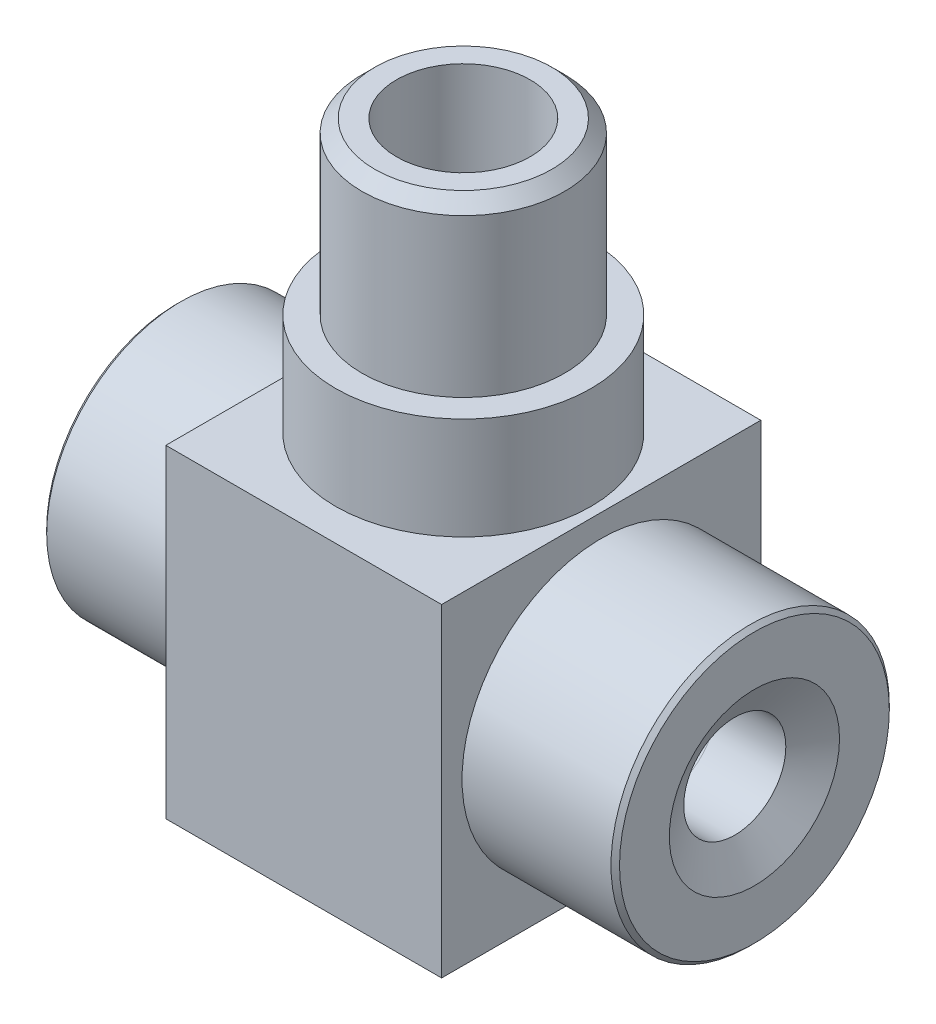
ISO-10303-21;
HEADER;
FILE_DESCRIPTION(('STEP AP214'),'2;1');
FILE_NAME('part.step','',(''),(''),'','','');
FILE_SCHEMA(('AUTOMOTIVE_DESIGN { 1 0 10303 214 1 1 1 1 }'));
ENDSEC;
DATA;
#1=APPLICATION_CONTEXT('core data for automotive mechanical design processes');
#2=APPLICATION_PROTOCOL_DEFINITION('international standard','automotive_design',2000,#1);
#3=PRODUCT_CONTEXT('',#1,'mechanical');
#4=PRODUCT('Part','Part','',(#3));
#5=PRODUCT_RELATED_PRODUCT_CATEGORY('part','',(#4));
#6=PRODUCT_DEFINITION_FORMATION('','',#4);
#7=PRODUCT_DEFINITION_CONTEXT('part definition',#1,'design');
#8=PRODUCT_DEFINITION('design','',#6,#7);
#9=PRODUCT_DEFINITION_SHAPE('','',#8);
#10=(LENGTH_UNIT() NAMED_UNIT(*) SI_UNIT(.MILLI.,.METRE.));
#11=(NAMED_UNIT(*) PLANE_ANGLE_UNIT() SI_UNIT($,.RADIAN.));
#12=(NAMED_UNIT(*) SI_UNIT($,.STERADIAN.) SOLID_ANGLE_UNIT());
#13=UNCERTAINTY_MEASURE_WITH_UNIT(LENGTH_MEASURE(1.E-05),#10,'distance_accuracy_value','');
#14=(GEOMETRIC_REPRESENTATION_CONTEXT(3) GLOBAL_UNCERTAINTY_ASSIGNED_CONTEXT((#13)) GLOBAL_UNIT_ASSIGNED_CONTEXT((#10,
#11,#12)) REPRESENTATION_CONTEXT('',''));
#15=CARTESIAN_POINT('',(0.,0.,0.));
#16=DIRECTION('',(0.,0.,1.));
#17=DIRECTION('',(1.,0.,0.));
#18=AXIS2_PLACEMENT_3D('',#15,#16,#17);
#19=CARTESIAN_POINT('',(0.,0.,37.5));
#20=DIRECTION('',(1.,0.,0.));
#21=DIRECTION('',(0.,0.,-1.));
#22=AXIS2_PLACEMENT_3D('',#19,#20,#21);
#23=PLANE('',#22);
#24=CARTESIAN_POINT('',(0.,19.,18.75));
#25=DIRECTION('',(-1.,0.,0.));
#26=DIRECTION('',(0.,0.,1.));
#27=AXIS2_PLACEMENT_3D('',#24,#25,#26);
#28=CIRCLE('',#27,15.75);
#29=CARTESIAN_POINT('',(0.,19.,34.5));
#30=VERTEX_POINT('',#29);
#31=EDGE_CURVE('E135',#30,#30,#28,.T.);
#32=ORIENTED_EDGE('',*,*,#31,.F.);
#33=EDGE_LOOP('',(#32));
#34=FACE_BOUND('',#33,.T.);
#35=DIRECTION('',(0.,-1.,0.));
#36=VECTOR('',#35,1.);
#37=CARTESIAN_POINT('',(0.,0.,0.));
#38=LINE('',#37,#36);
#39=CARTESIAN_POINT('',(0.,38.,0.));
#40=VERTEX_POINT('',#39);
#41=CARTESIAN_POINT('',(0.,0.,0.));
#42=VERTEX_POINT('',#41);
#43=EDGE_CURVE('E132',#40,#42,#38,.T.);
#44=ORIENTED_EDGE('',*,*,#43,.T.);
#45=DIRECTION('',(0.,0.,-1.));
#46=VECTOR('',#45,1.);
#47=CARTESIAN_POINT('',(0.,0.,37.5));
#48=LINE('',#47,#46);
#49=CARTESIAN_POINT('',(0.,0.,37.5));
#50=VERTEX_POINT('',#49);
#51=EDGE_CURVE('E139',#50,#42,#48,.T.);
#52=ORIENTED_EDGE('',*,*,#51,.F.);
#53=DIRECTION('',(0.,-1.,0.));
#54=VECTOR('',#53,1.);
#55=CARTESIAN_POINT('',(0.,0.,37.5));
#56=LINE('',#55,#54);
#57=CARTESIAN_POINT('',(0.,38.,37.5));
#58=VERTEX_POINT('',#57);
#59=EDGE_CURVE('E140',#58,#50,#56,.T.);
#60=ORIENTED_EDGE('',*,*,#59,.F.);
#61=DIRECTION('',(0.,0.,-1.));
#62=VECTOR('',#61,1.);
#63=CARTESIAN_POINT('',(0.,38.,37.5));
#64=LINE('',#63,#62);
#65=EDGE_CURVE('E146',#58,#40,#64,.T.);
#66=ORIENTED_EDGE('',*,*,#65,.T.);
#67=EDGE_LOOP('',(#44,#52,#60,#66));
#68=FACE_BOUND('',#67,.T.);
#69=ADVANCED_FACE('F45',(#34,#68),#23,.F.);
#70=CARTESIAN_POINT('',(0.,0.,37.5));
#71=DIRECTION('',(0.,1.,0.));
#72=DIRECTION('',(0.,0.,1.));
#73=AXIS2_PLACEMENT_3D('',#70,#71,#72);
#74=PLANE('',#73);
#75=DIRECTION('',(1.,0.,0.));
#76=VECTOR('',#75,1.);
#77=CARTESIAN_POINT('',(0.,0.,0.));
#78=LINE('',#77,#76);
#79=CARTESIAN_POINT('',(32.4,0.,0.));
#80=VERTEX_POINT('',#79);
#81=EDGE_CURVE('E149',#42,#80,#78,.T.);
#82=ORIENTED_EDGE('',*,*,#81,.T.);
#83=DIRECTION('',(0.,0.,-1.));
#84=VECTOR('',#83,1.);
#85=CARTESIAN_POINT('',(32.4,0.,37.5));
#86=LINE('',#85,#84);
#87=CARTESIAN_POINT('',(32.4,0.,37.5));
#88=VERTEX_POINT('',#87);
#89=EDGE_CURVE('E157',#88,#80,#86,.T.);
#90=ORIENTED_EDGE('',*,*,#89,.F.);
#91=DIRECTION('',(1.,0.,0.));
#92=VECTOR('',#91,1.);
#93=CARTESIAN_POINT('',(0.,0.,37.5));
#94=LINE('',#93,#92);
#95=EDGE_CURVE('E99',#50,#88,#94,.T.);
#96=ORIENTED_EDGE('',*,*,#95,.F.);
#97=ORIENTED_EDGE('',*,*,#51,.T.);
#98=EDGE_LOOP('',(#82,#90,#96,#97));
#99=FACE_BOUND('',#98,.T.);
#100=ADVANCED_FACE('F257',(#99),#74,.F.);
#101=CARTESIAN_POINT('',(32.4,0.,37.5));
#102=DIRECTION('',(-1.,0.,0.));
#103=DIRECTION('',(0.,0.,1.));
#104=AXIS2_PLACEMENT_3D('',#101,#102,#103);
#105=PLANE('',#104);
#106=CARTESIAN_POINT('',(32.4,19.,18.75));
#107=DIRECTION('',(1.,0.,0.));
#108=DIRECTION('',(0.,0.,-1.));
#109=AXIS2_PLACEMENT_3D('',#106,#107,#108);
#110=CIRCLE('',#109,16.35);
#111=CARTESIAN_POINT('',(32.4,19.,2.4));
#112=VERTEX_POINT('',#111);
#113=EDGE_CURVE('E162',#112,#112,#110,.T.);
#114=ORIENTED_EDGE('',*,*,#113,.F.);
#115=EDGE_LOOP('',(#114));
#116=FACE_BOUND('',#115,.T.);
#117=DIRECTION('',(0.,1.,0.));
#118=VECTOR('',#117,1.);
#119=CARTESIAN_POINT('',(32.4,0.,0.));
#120=LINE('',#119,#118);
#121=CARTESIAN_POINT('',(32.4,38.,0.));
#122=VERTEX_POINT('',#121);
#123=EDGE_CURVE('E151',#80,#122,#120,.T.);
#124=ORIENTED_EDGE('',*,*,#123,.T.);
#125=DIRECTION('',(0.,0.,-1.));
#126=VECTOR('',#125,1.);
#127=CARTESIAN_POINT('',(32.4,38.,37.5));
#128=LINE('',#127,#126);
#129=CARTESIAN_POINT('',(32.4,38.,37.5));
#130=VERTEX_POINT('',#129);
#131=EDGE_CURVE('E155',#130,#122,#128,.T.);
#132=ORIENTED_EDGE('',*,*,#131,.F.);
#133=DIRECTION('',(0.,1.,0.));
#134=VECTOR('',#133,1.);
#135=CARTESIAN_POINT('',(32.4,0.,37.5));
#136=LINE('',#135,#134);
#137=EDGE_CURVE('E143',#88,#130,#136,.T.);
#138=ORIENTED_EDGE('',*,*,#137,.F.);
#139=ORIENTED_EDGE('',*,*,#89,.T.);
#140=EDGE_LOOP('',(#124,#132,#138,#139));
#141=FACE_BOUND('',#140,.T.);
#142=ADVANCED_FACE('F253',(#116,#141),#105,.F.);
#143=CARTESIAN_POINT('',(0.,38.,37.5));
#144=DIRECTION('',(0.,-1.,0.));
#145=DIRECTION('',(0.,0.,-1.));
#146=AXIS2_PLACEMENT_3D('',#143,#144,#145);
#147=PLANE('',#146);
#148=CARTESIAN_POINT('',(16.2,38.,18.75));
#149=DIRECTION('',(0.,1.,0.));
#150=DIRECTION('',(0.,0.,1.));
#151=AXIS2_PLACEMENT_3D('',#148,#149,#150);
#152=CIRCLE('',#151,15.);
#153=CARTESIAN_POINT('',(16.2,38.,33.75));
#154=VERTEX_POINT('',#153);
#155=EDGE_CURVE('E175',#154,#154,#152,.T.);
#156=ORIENTED_EDGE('',*,*,#155,.F.);
#157=EDGE_LOOP('',(#156));
#158=FACE_BOUND('',#157,.T.);
#159=DIRECTION('',(-1.,0.,0.));
#160=VECTOR('',#159,1.);
#161=CARTESIAN_POINT('',(0.,38.,0.));
#162=LINE('',#161,#160);
#163=EDGE_CURVE('E91',#122,#40,#162,.T.);
#164=ORIENTED_EDGE('',*,*,#163,.T.);
#165=ORIENTED_EDGE('',*,*,#65,.F.);
#166=DIRECTION('',(-1.,0.,0.));
#167=VECTOR('',#166,1.);
#168=CARTESIAN_POINT('',(0.,38.,37.5));
#169=LINE('',#168,#167);
#170=EDGE_CURVE('E70',#130,#58,#169,.T.);
#171=ORIENTED_EDGE('',*,*,#170,.F.);
#172=ORIENTED_EDGE('',*,*,#131,.T.);
#173=EDGE_LOOP('',(#164,#165,#171,#172));
#174=FACE_BOUND('',#173,.T.);
#175=ADVANCED_FACE('F247',(#158,#174),#147,.F.);
#176=CARTESIAN_POINT('',(0.,0.,37.5));
#177=DIRECTION('',(0.,0.,-1.));
#178=DIRECTION('',(-1.,0.,0.));
#179=AXIS2_PLACEMENT_3D('',#176,#177,#178);
#180=PLANE('',#179);
#181=ORIENTED_EDGE('',*,*,#59,.T.);
#182=ORIENTED_EDGE('',*,*,#95,.T.);
#183=ORIENTED_EDGE('',*,*,#137,.T.);
#184=ORIENTED_EDGE('',*,*,#170,.T.);
#185=EDGE_LOOP('',(#181,#182,#183,#184));
#186=FACE_BOUND('',#185,.T.);
#187=ADVANCED_FACE('F244',(#186),#180,.F.);
#188=CARTESIAN_POINT('',(0.,0.,0.));
#189=DIRECTION('',(0.,0.,-1.));
#190=DIRECTION('',(-1.,0.,0.));
#191=AXIS2_PLACEMENT_3D('',#188,#189,#190);
#192=PLANE('',#191);
#193=ORIENTED_EDGE('',*,*,#43,.F.);
#194=ORIENTED_EDGE('',*,*,#163,.F.);
#195=ORIENTED_EDGE('',*,*,#123,.F.);
#196=ORIENTED_EDGE('',*,*,#81,.F.);
#197=EDGE_LOOP('',(#193,#194,#195,#196));
#198=FACE_BOUND('',#197,.T.);
#199=ADVANCED_FACE('F242',(#198),#192,.T.);
#200=CARTESIAN_POINT('',(-17.5,19.,18.75));
#201=DIRECTION('',(1.,0.,0.));
#202=DIRECTION('',(0.,0.,-1.));
#203=AXIS2_PLACEMENT_3D('',#200,#201,#202);
#204=CYLINDRICAL_SURFACE('',#203,15.75);
#205=CARTESIAN_POINT('',(-17.,19.,18.75));
#206=DIRECTION('',(-1.,0.,0.));
#207=DIRECTION('',(0.,0.,1.));
#208=AXIS2_PLACEMENT_3D('',#205,#206,#207);
#209=CIRCLE('',#208,15.75);
#210=CARTESIAN_POINT('',(-17.,19.,34.5));
#211=VERTEX_POINT('',#210);
#212=EDGE_CURVE('E298',#211,#211,#209,.F.);
#213=ORIENTED_EDGE('',*,*,#212,.T.);
#214=EDGE_LOOP('',(#213));
#215=FACE_BOUND('',#214,.T.);
#216=ORIENTED_EDGE('',*,*,#31,.T.);
#217=EDGE_LOOP('',(#216));
#218=FACE_BOUND('',#217,.T.);
#219=ADVANCED_FACE('F238',(#215,#218),#204,.T.);
#220=CARTESIAN_POINT('',(-17.5,19.,18.75));
#221=DIRECTION('',(-1.,0.,0.));
#222=DIRECTION('',(0.,0.,1.));
#223=AXIS2_PLACEMENT_3D('',#220,#221,#222);
#224=PLANE('',#223);
#225=CARTESIAN_POINT('',(-17.5,19.,18.75));
#226=DIRECTION('',(-1.,0.,0.));
#227=DIRECTION('',(0.,0.,1.));
#228=AXIS2_PLACEMENT_3D('',#225,#226,#227);
#229=CIRCLE('',#228,15.25);
#230=CARTESIAN_POINT('',(-17.5,19.,34.));
#231=VERTEX_POINT('',#230);
#232=EDGE_CURVE('E302',#231,#231,#229,.T.);
#233=ORIENTED_EDGE('',*,*,#232,.T.);
#234=EDGE_LOOP('',(#233));
#235=FACE_BOUND('',#234,.T.);
#236=CARTESIAN_POINT('',(-17.5,19.,18.75));
#237=DIRECTION('',(-1.,0.,0.));
#238=DIRECTION('',(0.,0.,1.));
#239=AXIS2_PLACEMENT_3D('',#236,#237,#238);
#240=CIRCLE('',#239,9.3);
#241=CARTESIAN_POINT('',(-17.5,19.,28.05));
#242=VERTEX_POINT('',#241);
#243=EDGE_CURVE('E126',#242,#242,#240,.T.);
#244=ORIENTED_EDGE('',*,*,#243,.F.);
#245=EDGE_LOOP('',(#244));
#246=FACE_BOUND('',#245,.T.);
#247=ADVANCED_FACE('F234',(#235,#246),#224,.T.);
#248=CARTESIAN_POINT('',(0.499999999999997,19.,18.75));
#249=DIRECTION('',(-1.,0.,0.));
#250=DIRECTION('',(0.,0.,1.));
#251=AXIS2_PLACEMENT_3D('',#248,#249,#250);
#252=CYLINDRICAL_SURFACE('',#251,9.3);
#253=CARTESIAN_POINT('',(0.499999999999997,19.,18.75));
#254=DIRECTION('',(-1.,0.,0.));
#255=DIRECTION('',(0.,0.,1.));
#256=AXIS2_PLACEMENT_3D('',#253,#254,#255);
#257=CIRCLE('',#256,9.3);
#258=CARTESIAN_POINT('',(0.499999999999997,19.,28.05));
#259=VERTEX_POINT('',#258);
#260=EDGE_CURVE('E129',#259,#259,#257,.T.);
#261=ORIENTED_EDGE('',*,*,#260,.F.);
#262=EDGE_LOOP('',(#261));
#263=FACE_BOUND('',#262,.T.);
#264=ORIENTED_EDGE('',*,*,#243,.T.);
#265=EDGE_LOOP('',(#264));
#266=FACE_BOUND('',#265,.T.);
#267=ADVANCED_FACE('F231',(#263,#266),#252,.F.);
#268=CARTESIAN_POINT('',(0.499999999999997,19.,18.75));
#269=DIRECTION('',(-1.,0.,0.));
#270=DIRECTION('',(0.,0.,1.));
#271=AXIS2_PLACEMENT_3D('',#268,#269,#270);
#272=PLANE('',#271);
#273=CARTESIAN_POINT('',(0.499999999999997,15.,18.75));
#274=DIRECTION('',(-1.,0.,0.));
#275=DIRECTION('',(0.,0.,1.));
#276=AXIS2_PLACEMENT_3D('',#273,#274,#275);
#277=CIRCLE('',#276,2.);
#278=CARTESIAN_POINT('',(0.499999999999997,15.5,16.8135083268963));
#279=VERTEX_POINT('',#278);
#280=CARTESIAN_POINT('',(0.499999999999997,15.5,20.6864916731037));
#281=VERTEX_POINT('',#280);
#282=EDGE_CURVE('E107',#279,#281,#277,.T.);
#283=ORIENTED_EDGE('',*,*,#282,.F.);
#284=CARTESIAN_POINT('',(0.499999999999997,19.,18.75));
#285=DIRECTION('',(-1.,0.,0.));
#286=DIRECTION('',(0.,0.,1.));
#287=AXIS2_PLACEMENT_3D('',#284,#285,#286);
#288=CIRCLE('',#287,4.);
#289=EDGE_CURVE('E119',#281,#279,#288,.T.);
#290=ORIENTED_EDGE('',*,*,#289,.F.);
#291=EDGE_LOOP('',(#283,#290));
#292=FACE_BOUND('',#291,.T.);
#293=ORIENTED_EDGE('',*,*,#260,.T.);
#294=EDGE_LOOP('',(#293));
#295=FACE_BOUND('',#294,.T.);
#296=ADVANCED_FACE('F123',(#292,#295),#272,.T.);
#297=CARTESIAN_POINT('',(2.9,19.,18.75));
#298=DIRECTION('',(-1.,0.,0.));
#299=DIRECTION('',(0.,0.,1.));
#300=AXIS2_PLACEMENT_3D('',#297,#298,#299);
#301=CYLINDRICAL_SURFACE('',#300,4.);
#302=CARTESIAN_POINT('',(2.9,19.,18.75));
#303=DIRECTION('',(-1.,0.,0.));
#304=DIRECTION('',(0.,0.,1.));
#305=AXIS2_PLACEMENT_3D('',#302,#303,#304);
#306=CIRCLE('',#305,4.);
#307=CARTESIAN_POINT('',(2.9,15.5,20.6864916731037));
#308=VERTEX_POINT('',#307);
#309=CARTESIAN_POINT('',(2.9,15.5,16.8135083268963));
#310=VERTEX_POINT('',#309);
#311=EDGE_CURVE('E121',#308,#310,#306,.T.);
#312=ORIENTED_EDGE('',*,*,#311,.F.);
#313=DIRECTION('',(-1.,0.,0.));
#314=VECTOR('',#313,1.);
#315=CARTESIAN_POINT('',(9.8,15.5,20.6864916731037));
#316=LINE('',#315,#314);
#317=EDGE_CURVE('E61',#308,#281,#316,.T.);
#318=ORIENTED_EDGE('',*,*,#317,.T.);
#319=ORIENTED_EDGE('',*,*,#289,.T.);
#320=DIRECTION('',(-1.,0.,0.));
#321=VECTOR('',#320,1.);
#322=CARTESIAN_POINT('',(9.8,15.5,16.8135083268963));
#323=LINE('',#322,#321);
#324=EDGE_CURVE('E110',#279,#310,#323,.F.);
#325=ORIENTED_EDGE('',*,*,#324,.T.);
#326=EDGE_LOOP('',(#312,#318,#319,#325));
#327=FACE_BOUND('',#326,.T.);
#328=ADVANCED_FACE('F118',(#327),#301,.F.);
#329=CARTESIAN_POINT('',(2.9,19.,18.75));
#330=DIRECTION('',(-1.,0.,0.));
#331=DIRECTION('',(0.,0.,1.));
#332=AXIS2_PLACEMENT_3D('',#329,#330,#331);
#333=PLANE('',#332);
#334=CARTESIAN_POINT('',(2.9,15.,18.75));
#335=DIRECTION('',(-1.,0.,0.));
#336=DIRECTION('',(0.,0.,1.));
#337=AXIS2_PLACEMENT_3D('',#334,#335,#336);
#338=CIRCLE('',#337,2.);
#339=EDGE_CURVE('E138',#308,#310,#338,.T.);
#340=ORIENTED_EDGE('',*,*,#339,.F.);
#341=ORIENTED_EDGE('',*,*,#311,.T.);
#342=EDGE_LOOP('',(#340,#341));
#343=FACE_BOUND('',#342,.T.);
#344=ADVANCED_FACE('F221',(#343),#333,.T.);
#345=CARTESIAN_POINT('',(19.1,15.,18.75));
#346=DIRECTION('',(-1.,0.,0.));
#347=DIRECTION('',(0.,0.,1.));
#348=AXIS2_PLACEMENT_3D('',#345,#346,#347);
#349=CYLINDRICAL_SURFACE('',#348,2.);
#350=CARTESIAN_POINT('',(12.1688711258507,15.,20.75));
#351=CARTESIAN_POINT('',(12.1688654754809,14.8940960075364,20.749994845946));
#352=CARTESIAN_POINT('',(12.1646370580432,14.7880204003675,20.741534564925));
#353=CARTESIAN_POINT('',(12.1482947441444,14.5789927534369,20.708063879802));
#354=CARTESIAN_POINT('',(12.1361608573423,14.4760493265402,20.6830115171003));
#355=CARTESIAN_POINT('',(12.1056734527162,14.276686661753,20.6175585342882));
#356=CARTESIAN_POINT('',(12.0873477072056,14.1802405586167,20.5772263523974));
#357=CARTESIAN_POINT('',(12.046583611169,13.9955085200925,20.4825641714106));
#358=CARTESIAN_POINT('',(12.0241458422428,13.9072214333559,20.4282361514295));
#359=CARTESIAN_POINT('',(11.9759067038502,13.7349947064041,20.3030018797566));
#360=CARTESIAN_POINT('',(11.9499817406305,13.651702379109,20.2312525897757));
#361=CARTESIAN_POINT('',(11.8986983452791,13.4978463794969,20.0749775726925));
#362=CARTESIAN_POINT('',(11.8733401536952,13.4272880250785,19.9904465346985));
#363=CARTESIAN_POINT('',(11.8245094868555,13.2974363788131,19.8057677022595));
#364=CARTESIAN_POINT('',(11.8011971519924,13.2388929147893,19.7050464520331));
#365=CARTESIAN_POINT('',(11.7606253808719,13.1398668377348,19.4939588712212));
#366=CARTESIAN_POINT('',(11.7433629064172,13.0993751564379,19.3835974167661));
#367=CARTESIAN_POINT('',(11.7177163998329,13.0400153309625,19.1631791162345));
#368=CARTESIAN_POINT('',(11.7088737925011,13.0200250592559,19.0534789509025));
#369=CARTESIAN_POINT('',(11.699383064831,12.9985876527568,18.8319497402519));
#370=CARTESIAN_POINT('',(11.6987311292096,12.9971318844338,18.7201217104243));
#371=CARTESIAN_POINT('',(11.7054413723545,13.0122649050051,18.5057554421316));
#372=CARTESIAN_POINT('',(11.7122531245509,13.0276142971369,18.4031090532758));
#373=CARTESIAN_POINT('',(11.7323452522346,13.0737682258513,18.2020268405944));
#374=CARTESIAN_POINT('',(11.7456261068095,13.104573907098,18.1035913292047));
#375=CARTESIAN_POINT('',(11.7776494333513,13.1810974465275,17.9119002288363));
#376=CARTESIAN_POINT('',(11.7964720748493,13.2270354641046,17.8187464751077));
#377=CARTESIAN_POINT('',(11.8377829933051,13.3322837591184,17.6412251429009));
#378=CARTESIAN_POINT('',(11.8602726056118,13.391598910943,17.5568607835437));
#379=CARTESIAN_POINT('',(11.9087920018052,13.5273187397619,17.3922577062266));
#380=CARTESIAN_POINT('',(11.9349611032174,13.6047001513247,17.3128643391118));
#381=CARTESIAN_POINT('',(11.9866238829718,13.7716533150306,17.1677849237987));
#382=CARTESIAN_POINT('',(12.012117219626,13.8612310986921,17.1021056986818));
#383=CARTESIAN_POINT('',(12.0606173706771,14.0546954041424,16.9837094216367));
#384=CARTESIAN_POINT('',(12.0834763417536,14.1590225751376,16.9316464025729));
#385=CARTESIAN_POINT('',(12.1222911806577,14.3762433356194,16.8461829820641));
#386=CARTESIAN_POINT('',(12.1382527622511,14.4891297431869,16.8127671266812));
#387=CARTESIAN_POINT('',(12.1599886011254,14.7117707571912,16.7678567301618));
#388=CARTESIAN_POINT('',(12.1664034320343,14.821182336561,16.7549791345838));
#389=CARTESIAN_POINT('',(12.1701569966405,15.0407678949219,16.7474037911655));
#390=CARTESIAN_POINT('',(12.1674996685784,15.1509415223833,16.7526981548503));
#391=CARTESIAN_POINT('',(12.1540771096382,15.3599260820209,16.7800505019307));
#392=CARTESIAN_POINT('',(12.1439538175059,15.4589574833891,16.8007824265676));
#393=CARTESIAN_POINT('',(12.1176015988103,15.6520241716129,16.8565987053885));
#394=CARTESIAN_POINT('',(12.1013711069214,15.7460581705352,16.8916867393634));
#395=CARTESIAN_POINT('',(12.063756456985,15.931183934964,16.9769389749489));
#396=CARTESIAN_POINT('',(12.0421741858521,16.0219557600174,17.0277075339259));
#397=CARTESIAN_POINT('',(11.996534938976,16.1941636211632,17.1423052442638));
#398=CARTESIAN_POINT('',(11.972476801683,16.2755952370762,17.2061405398872));
#399=CARTESIAN_POINT('',(11.9218417011731,16.4348780958649,17.3521882649405));
#400=CARTESIAN_POINT('',(11.8952425717971,16.5116543051134,17.4355704012763));
#401=CARTESIAN_POINT('',(11.8445981119452,16.6503639401814,17.6146049894662));
#402=CARTESIAN_POINT('',(11.820553142668,16.7122952682512,17.7102591725707));
#403=CARTESIAN_POINT('',(11.7774014521205,16.8198434012168,17.9125095664967));
#404=CARTESIAN_POINT('',(11.7583386916143,16.8653162513235,18.0191923060331));
#405=CARTESIAN_POINT('',(11.7276371057669,16.937291730698,18.2397708027772));
#406=CARTESIAN_POINT('',(11.715993186549,16.963807377768,18.3536615516741));
#407=CARTESIAN_POINT('',(11.70209931183,16.9953168417001,18.5758857424596));
#408=CARTESIAN_POINT('',(11.6991907946577,17.001820409428,18.6839650764729));
#409=CARTESIAN_POINT('',(11.7011978159582,16.9973051398305,18.899670109771));
#410=CARTESIAN_POINT('',(11.7061116226679,16.9862901808846,19.0072959041751));
#411=CARTESIAN_POINT('',(11.7228437385024,16.9481275977651,19.2140767593867));
#412=CARTESIAN_POINT('',(11.7343460092302,16.9217174926349,19.3133957823355));
#413=CARTESIAN_POINT('',(11.7629081500118,16.8543761904889,19.5061179532406));
#414=CARTESIAN_POINT('',(11.7799689949602,16.8134424461219,19.5995200600194));
#415=CARTESIAN_POINT('',(11.8190066676703,16.7161514669342,19.7824971132625));
#416=CARTESIAN_POINT('',(11.8411729710905,16.6591733135064,19.871700441136));
#417=CARTESIAN_POINT('',(11.8878821604987,16.5322660024435,20.0396715958599));
#418=CARTESIAN_POINT('',(11.9124260499165,16.4623313652272,20.1184349831628));
#419=CARTESIAN_POINT('',(11.9635909201895,16.3050352560919,20.2697738304058));
#420=CARTESIAN_POINT('',(11.9902232130091,16.2167349511258,20.341373030715));
#421=CARTESIAN_POINT('',(12.0406812908481,16.028651296375,20.468950306289));
#422=CARTESIAN_POINT('',(12.0645053176205,15.9288608291047,20.5249186248139));
#423=CARTESIAN_POINT('',(12.1064060485751,15.7197445810451,20.6195429827875));
#424=CARTESIAN_POINT('',(12.1244603432878,15.6103836731994,20.6581317523494));
#425=CARTESIAN_POINT('',(12.1519690321072,15.3858092794601,20.7158326362609));
#426=CARTESIAN_POINT('',(12.1614522728447,15.2706168131761,20.7350101073653));
#427=CARTESIAN_POINT('',(12.1668929271312,15.128943512372,20.7460073135799));
#428=CARTESIAN_POINT('',(12.1676331480938,15.1031862568132,20.7475030821723));
#429=CARTESIAN_POINT('',(12.168622942877,15.0516227344512,20.7495000672147));
#430=CARTESIAN_POINT('',(12.1688725032547,15.0258164663244,20.7500012564159));
#431=CARTESIAN_POINT('',(12.1688711258507,15.,20.75));
#432=B_SPLINE_CURVE_WITH_KNOTS('',3,(#350,#351,#352,#353,#354,#355,#356,#357,#358,#359,#360,
#361,#362,#363,#364,#365,#366,#367,#368,#369,#370,#371,#372,#373,#374,#375,#376,#377,#378,#379,
#380,#381,#382,#383,#384,#385,#386,#387,#388,#389,#390,#391,#392,#393,#394,#395,#396,#397,#398,
#399,#400,#401,#402,#403,#404,#405,#406,#407,#408,#409,#410,#411,#412,#413,#414,#415,#416,#417,
#418,#419,#420,#421,#422,#423,#424,#425,#426,#427,#428,#429,#430,#431),.UNSPECIFIED.,.T.,.F.,(4,
2,2,2,2,2,2,2,2,2,2,2,2,2,2,2,2,2,2,2,2,2,2,2,2,2,2,2,2,2,2,2,2,2,2,2,2,2,2,2,4),(0.,
0.31760334437537,0.636012936965872,0.953012920070959,1.26996810161855,1.6073589609112,
1.94489039529369,2.29948552911719,2.65390233172428,2.98767546043325,3.3212931090692,
3.63186770859037,3.94246531208843,4.2577975938606,4.57324496324738,4.91348424244389,
5.25389239679148,5.60848267098925,5.96277863847742,6.29202080550634,6.62112006609385,
6.92480624185222,7.22857030796274,7.54592692136879,7.86343310695169,8.21110201111792,
8.55882001591001,8.90950977437052,9.25995848428581,9.58322590889841,9.9064217761665,
10.2152769219976,10.5241862657993,10.8472538994055,11.1704584786024,11.5191241833328,
11.8680070399787,12.2182289273672,12.5672676750844,12.6446884712522,12.7221113884988),.UNSPECIFIED.);
#433=CARTESIAN_POINT('',(12.1688711258507,15.,20.75));
#434=VERTEX_POINT('',#433);
#435=EDGE_CURVE('E184',#434,#434,#432,.T.);
#436=ORIENTED_EDGE('',*,*,#435,.T.);
#437=EDGE_LOOP('',(#436));
#438=FACE_BOUND('',#437,.T.);
#439=ORIENTED_EDGE('',*,*,#339,.T.);
#440=ORIENTED_EDGE('',*,*,#324,.F.);
#441=ORIENTED_EDGE('',*,*,#282,.T.);
#442=ORIENTED_EDGE('',*,*,#317,.F.);
#443=EDGE_LOOP('',(#439,#440,#441,#442));
#444=FACE_BOUND('',#443,.T.);
#445=ADVANCED_FACE('F108',(#438,#444),#349,.F.);
#446=CARTESIAN_POINT('',(50.4,19.,18.75));
#447=DIRECTION('',(-1.,0.,0.));
#448=DIRECTION('',(0.,0.,1.));
#449=AXIS2_PLACEMENT_3D('',#446,#447,#448);
#450=CYLINDRICAL_SURFACE('',#449,16.35);
#451=CARTESIAN_POINT('',(49.9,19.,18.75));
#452=DIRECTION('',(1.,0.,0.));
#453=DIRECTION('',(0.,0.,-1.));
#454=AXIS2_PLACEMENT_3D('',#451,#452,#453);
#455=CIRCLE('',#454,16.35);
#456=CARTESIAN_POINT('',(49.9,19.,2.4));
#457=VERTEX_POINT('',#456);
#458=EDGE_CURVE('E293',#457,#457,#455,.F.);
#459=ORIENTED_EDGE('',*,*,#458,.T.);
#460=EDGE_LOOP('',(#459));
#461=FACE_BOUND('',#460,.T.);
#462=ORIENTED_EDGE('',*,*,#113,.T.);
#463=EDGE_LOOP('',(#462));
#464=FACE_BOUND('',#463,.T.);
#465=ADVANCED_FACE('F220',(#461,#464),#450,.T.);
#466=CARTESIAN_POINT('',(50.4,19.,18.75));
#467=DIRECTION('',(1.,0.,0.));
#468=DIRECTION('',(0.,0.,-1.));
#469=AXIS2_PLACEMENT_3D('',#466,#467,#468);
#470=PLANE('',#469);
#471=CARTESIAN_POINT('',(50.4,19.,18.75));
#472=DIRECTION('',(1.,0.,0.));
#473=DIRECTION('',(0.,0.,-1.));
#474=AXIS2_PLACEMENT_3D('',#471,#472,#473);
#475=CIRCLE('',#474,15.85);
#476=CARTESIAN_POINT('',(50.4,19.,2.9));
#477=VERTEX_POINT('',#476);
#478=EDGE_CURVE('E296',#477,#477,#475,.T.);
#479=ORIENTED_EDGE('',*,*,#478,.T.);
#480=EDGE_LOOP('',(#479));
#481=FACE_BOUND('',#480,.T.);
#482=CARTESIAN_POINT('',(50.4,19.,18.75));
#483=DIRECTION('',(1.,0.,0.));
#484=DIRECTION('',(0.,0.,-1.));
#485=AXIS2_PLACEMENT_3D('',#482,#483,#484);
#486=CIRCLE('',#485,10.);
#487=CARTESIAN_POINT('',(50.4,19.,8.74999999999999));
#488=VERTEX_POINT('',#487);
#489=EDGE_CURVE('E166',#488,#488,#486,.F.);
#490=ORIENTED_EDGE('',*,*,#489,.T.);
#491=EDGE_LOOP('',(#490));
#492=FACE_BOUND('',#491,.T.);
#493=ADVANCED_FACE('F365',(#481,#492),#470,.T.);
#494=CARTESIAN_POINT('',(37.9,19.,18.75));
#495=DIRECTION('',(1.,0.,0.));
#496=DIRECTION('',(0.,0.,-1.));
#497=AXIS2_PLACEMENT_3D('',#494,#495,#496);
#498=CYLINDRICAL_SURFACE('',#497,6.);
#499=CARTESIAN_POINT('',(39.9,19.,18.75));
#500=DIRECTION('',(1.,0.,0.));
#501=DIRECTION('',(0.,0.,-1.));
#502=AXIS2_PLACEMENT_3D('',#499,#500,#501);
#503=CIRCLE('',#502,6.);
#504=CARTESIAN_POINT('',(39.9,19.,12.75));
#505=VERTEX_POINT('',#504);
#506=EDGE_CURVE('E172',#505,#505,#503,.F.);
#507=ORIENTED_EDGE('',*,*,#506,.T.);
#508=EDGE_LOOP('',(#507));
#509=FACE_BOUND('',#508,.T.);
#510=CARTESIAN_POINT('',(48.0905989232415,19.,18.75));
#511=DIRECTION('',(1.,0.,0.));
#512=DIRECTION('',(0.,0.,-1.));
#513=AXIS2_PLACEMENT_3D('',#510,#511,#512);
#514=CIRCLE('',#513,6.);
#515=CARTESIAN_POINT('',(48.0905989232415,19.,12.75));
#516=VERTEX_POINT('',#515);
#517=EDGE_CURVE('E163',#516,#516,#514,.T.);
#518=ORIENTED_EDGE('',*,*,#517,.T.);
#519=EDGE_LOOP('',(#518));
#520=FACE_BOUND('',#519,.T.);
#521=ADVANCED_FACE('F370',(#509,#520),#498,.F.);
#522=CARTESIAN_POINT('',(37.9,19.,18.75));
#523=DIRECTION('',(1.,0.,0.));
#524=DIRECTION('',(0.,0.,-1.));
#525=AXIS2_PLACEMENT_3D('',#522,#523,#524);
#526=PLANE('',#525);
#527=CARTESIAN_POINT('',(37.9,19.,18.75));
#528=DIRECTION('',(1.,0.,0.));
#529=DIRECTION('',(0.,0.,-1.));
#530=AXIS2_PLACEMENT_3D('',#527,#528,#529);
#531=CIRCLE('',#530,4.);
#532=CARTESIAN_POINT('',(37.9,19.,14.75));
#533=VERTEX_POINT('',#532);
#534=EDGE_CURVE('E169',#533,#533,#531,.T.);
#535=ORIENTED_EDGE('',*,*,#534,.T.);
#536=EDGE_LOOP('',(#535));
#537=FACE_BOUND('',#536,.T.);
#538=CARTESIAN_POINT('',(37.9,19.,18.75));
#539=DIRECTION('',(1.,0.,0.));
#540=DIRECTION('',(0.,0.,-1.));
#541=AXIS2_PLACEMENT_3D('',#538,#539,#540);
#542=CIRCLE('',#541,2.5);
#543=CARTESIAN_POINT('',(37.9,19.,16.25));
#544=VERTEX_POINT('',#543);
#545=EDGE_CURVE('E114',#544,#544,#542,.T.);
#546=ORIENTED_EDGE('',*,*,#545,.F.);
#547=EDGE_LOOP('',(#546));
#548=FACE_BOUND('',#547,.T.);
#549=ADVANCED_FACE('F267',(#537,#548),#526,.T.);
#550=CARTESIAN_POINT('',(48.0905989232415,19.,18.75));
#551=DIRECTION('',(1.,0.,0.));
#552=DIRECTION('',(0.,0.,-1.));
#553=AXIS2_PLACEMENT_3D('',#550,#551,#552);
#554=CONICAL_SURFACE('',#553,6.,1.0471975511966);
#555=ORIENTED_EDGE('',*,*,#489,.F.);
#556=EDGE_LOOP('',(#555));
#557=FACE_BOUND('',#556,.T.);
#558=ORIENTED_EDGE('',*,*,#517,.F.);
#559=EDGE_LOOP('',(#558));
#560=FACE_BOUND('',#559,.T.);
#561=ADVANCED_FACE('F264',(#557,#560),#554,.F.);
#562=CARTESIAN_POINT('',(16.2,19.,18.75));
#563=DIRECTION('',(1.,0.,0.));
#564=DIRECTION('',(0.,0.,-1.));
#565=AXIS2_PLACEMENT_3D('',#562,#563,#564);
#566=CYLINDRICAL_SURFACE('',#565,2.5);
#567=CARTESIAN_POINT('',(19.9416573867739,19.,16.25));
#568=CARTESIAN_POINT('',(19.9416726873018,18.8721323396009,16.2500113220494));
#569=CARTESIAN_POINT('',(19.9483170497897,18.7441529674524,16.2598795376881));
#570=CARTESIAN_POINT('',(19.97384839882,18.4923201029541,16.2987616581353));
#571=CARTESIAN_POINT('',(19.9927555117257,18.3684737459366,16.3278070390731));
#572=CARTESIAN_POINT('',(20.0398993382271,18.1290548830458,16.4032748146643));
#573=CARTESIAN_POINT('',(20.0680766759946,18.013435273413,16.4495868614897));
#574=CARTESIAN_POINT('',(20.1304894158798,17.7916539989819,16.5579342118591));
#575=CARTESIAN_POINT('',(20.1647261630753,17.6854944420248,16.6199730077777));
#576=CARTESIAN_POINT('',(20.2396940348001,17.4735832846136,16.7655015383178));
#577=CARTESIAN_POINT('',(20.2807306976683,17.3690064220367,16.8505450603285));
#578=CARTESIAN_POINT('',(20.3622229945264,17.1746536694825,17.0364624889203));
#579=CARTESIAN_POINT('',(20.4026782589736,17.0848868433534,17.1373460165376));
#580=CARTESIAN_POINT('',(20.482696406447,16.9149101674806,17.3629014771508));
#581=CARTESIAN_POINT('',(20.5218664679031,16.8362396702721,17.4888863034949));
#582=CARTESIAN_POINT('',(20.5907371497202,16.7017583366495,17.7548915688457));
#583=CARTESIAN_POINT('',(20.6204451281028,16.6459297279822,17.894900989947));
#584=CARTESIAN_POINT('',(20.6648062287859,16.5636943117973,18.1724575455885));
#585=CARTESIAN_POINT('',(20.6805196628677,16.5351993970642,18.3092124095443));
#586=CARTESIAN_POINT('',(20.6991626948253,16.5014655122546,18.5863830589989));
#587=CARTESIAN_POINT('',(20.7021022263727,16.4962084711067,18.7267959143272));
#588=CARTESIAN_POINT('',(20.6952695276662,16.5085234963156,18.9911789107194));
#589=CARTESIAN_POINT('',(20.6868211214875,16.5237178496382,19.1153038458625));
#590=CARTESIAN_POINT('',(20.6602965292815,16.5721090033326,19.3589064725007));
#591=CARTESIAN_POINT('',(20.6422196011106,16.6053071914009,19.4783838050078));
#592=CARTESIAN_POINT('',(20.5978060171242,16.6887335049168,19.7109796531948));
#593=CARTESIAN_POINT('',(20.5713861183467,16.7391336940186,19.8240199020297));
#594=CARTESIAN_POINT('',(20.5125199735291,16.8551626151488,20.0402505984926));
#595=CARTESIAN_POINT('',(20.4800718351567,16.9207961307072,20.1434379377399));
#596=CARTESIAN_POINT('',(20.4078528663051,17.0735934614955,20.3490962096578));
#597=CARTESIAN_POINT('',(20.3676693204804,17.1623260278371,20.4502574739773));
#598=CARTESIAN_POINT('',(20.2865010622015,17.3546682688736,20.6370355662016));
#599=CARTESIAN_POINT('',(20.2455155428489,17.4582936713044,20.7226357414321));
#600=CARTESIAN_POINT('',(20.163123978611,17.6889207082924,20.8836709009596));
#601=CARTESIAN_POINT('',(20.1220171494115,17.8171902179464,20.9574790161184));
#602=CARTESIAN_POINT('',(20.0674917760897,18.0193309921106,21.0508285502792));
#603=CARTESIAN_POINT('',(20.0505034104038,18.0883471419892,21.0790547633323));
#604=CARTESIAN_POINT('',(20.0196052952535,18.2292237904501,21.1293879141019));
#605=CARTESIAN_POINT('',(20.0056934430533,18.301082306485,21.1514990339696));
#606=CARTESIAN_POINT('',(19.9825660454845,18.4412551771517,21.1877489372537));
#607=CARTESIAN_POINT('',(19.97306418692,18.5093943122614,21.2023833583374));
#608=CARTESIAN_POINT('',(19.9576487087459,18.6470200576638,21.2259392049674));
#609=CARTESIAN_POINT('',(19.9517329765312,18.7165058496854,21.2348639942583));
#610=CARTESIAN_POINT('',(19.9437735839187,18.8561551646247,21.2468406736909));
#611=CARTESIAN_POINT('',(19.9417269363782,18.9263181226313,21.2498970945591));
#612=CARTESIAN_POINT('',(19.941591158466,19.0666321128593,21.2500979353415));
#613=CARTESIAN_POINT('',(19.9435015737046,19.1367831455251,21.247243034053));
#614=CARTESIAN_POINT('',(19.9539066922312,19.325212663635,21.23160454094));
#615=CARTESIAN_POINT('',(19.9660681233637,19.4428851675594,21.2132791289111));
#616=CARTESIAN_POINT('',(19.9999967187886,19.6730616317667,21.1605964113588));
#617=CARTESIAN_POINT('',(20.0217682717268,19.7855632046983,21.1262317808079));
#618=CARTESIAN_POINT('',(20.0734200279313,20.0077418055562,21.0411100941392));
#619=CARTESIAN_POINT('',(20.103597650075,20.1171109257016,20.9897353611686));
#620=CARTESIAN_POINT('',(20.1685293089739,20.3263257689031,20.8725595783816));
#621=CARTESIAN_POINT('',(20.2032855762368,20.4261668091685,20.8067514868336));
#622=CARTESIAN_POINT('',(20.2802130806217,20.6304906252537,20.6501686403728));
#623=CARTESIAN_POINT('',(20.3226722442094,20.7330968256877,20.5570752676726));
#624=CARTESIAN_POINT('',(20.4055765594881,20.921999358086,20.3547090011428));
#625=CARTESIAN_POINT('',(20.446020455342,21.0082856114409,20.2454261830944));
#626=CARTESIAN_POINT('',(20.523008754933,21.1664329420355,20.0062604275829));
#627=CARTESIAN_POINT('',(20.5592262624207,21.237268076194,19.8755854721733));
#628=CARTESIAN_POINT('',(20.6209063789503,21.3551963131882,19.6016021654531));
#629=CARTESIAN_POINT('',(20.6463803344281,21.4023144741272,19.4583073365757));
#630=CARTESIAN_POINT('',(20.681485199124,21.4666477791198,19.178990109063));
#631=CARTESIAN_POINT('',(20.6924747326529,21.486437422315,19.0437326732373));
#632=CARTESIAN_POINT('',(20.7020067452551,21.5036224015053,18.7713910904093));
#633=CARTESIAN_POINT('',(20.7005560835842,21.5010300784294,18.6343079916669));
#634=CARTESIAN_POINT('',(20.6861017529253,21.4749143746661,18.3756625393492));
#635=CARTESIAN_POINT('',(20.6741753180592,21.4533423582357,18.2538342593847));
#636=CARTESIAN_POINT('',(20.6413325736809,21.3929222824186,18.0158328449745));
#637=CARTESIAN_POINT('',(20.620415212062,21.3540722011564,17.8996603741361));
#638=CARTESIAN_POINT('',(20.5705432910913,21.2590561244478,17.6718522438569));
#639=CARTESIAN_POINT('',(20.541347259891,21.202363175809,17.560491023726));
#640=CARTESIAN_POINT('',(20.477627720165,21.0739354226256,17.3485110387714));
#641=CARTESIAN_POINT('',(20.4431021134758,21.0021946900155,17.2478965312547));
#642=CARTESIAN_POINT('',(20.367171955601,20.8361351797567,17.0478208392219));
#643=CARTESIAN_POINT('',(20.3254345017689,20.7401602264378,16.9498575565794));
#644=CARTESIAN_POINT('',(20.2425254134758,20.533304183114,16.7706674976889));
#645=CARTESIAN_POINT('',(20.2013545489803,20.4224046656363,16.6894617311876));
#646=CARTESIAN_POINT('',(20.1212240848222,20.1789993623462,16.5405519776071));
#647=CARTESIAN_POINT('',(20.0826265303192,20.045520405037,16.4742082130855));
#648=CARTESIAN_POINT('',(20.0334300904575,19.8365266679135,16.3929224772675));
#649=CARTESIAN_POINT('',(20.018489769267,19.7654600807093,16.3688775554243));
#650=CARTESIAN_POINT('',(19.9921532547715,19.6208613995251,16.3271540053638));
#651=CARTESIAN_POINT('',(19.9807548341382,19.5473308873525,16.3094713751026));
#652=CARTESIAN_POINT('',(19.9617084132447,19.3954098742597,16.2802079522334));
#653=CARTESIAN_POINT('',(19.9542323664776,19.3169434783972,16.2689054886822));
#654=CARTESIAN_POINT('',(19.9442022253849,19.15899908791,16.2537981897745));
#655=CARTESIAN_POINT('',(19.9416478713459,19.0795211468866,16.2499929587954));
#656=CARTESIAN_POINT('',(19.9416573867739,19.,16.25));
#657=B_SPLINE_CURVE_WITH_KNOTS('',3,(#567,#568,#569,#570,#571,#572,#573,#574,#575,#576,#577,
#578,#579,#580,#581,#582,#583,#584,#585,#586,#587,#588,#589,#590,#591,#592,#593,#594,#595,#596,
#597,#598,#599,#600,#601,#602,#603,#604,#605,#606,#607,#608,#609,#610,#611,#612,#613,#614,#615,
#616,#617,#618,#619,#620,#621,#622,#623,#624,#625,#626,#627,#628,#629,#630,#631,#632,#633,#634,
#635,#636,#637,#638,#639,#640,#641,#642,#643,#644,#645,#646,#647,#648,#649,#650,#651,#652,#653,
#654,#655,#656),.UNSPECIFIED.,.T.,.F.,(4,2,2,2,2,2,2,2,2,2,2,2,2,2,2,2,2,2,2,2,2,2,2,2,2,2,2,2,
2,2,2,2,2,2,2,2,2,2,2,2,2,2,2,2,4),(0.,0.383275383121335,0.767181418165754,1.14867490739205,
1.5302531876378,1.95124472962169,2.37249297328885,2.8308639411325,3.28887758966411,
3.70817544329898,4.12714717001845,4.50138183787381,4.87564535502261,5.25376784587463,
5.63200923481063,6.05157027592399,6.47157769989119,6.92969119559362,7.15882945779302,
7.38781062115844,7.59850621559528,7.80907756727165,8.01948627997721,8.22987083278616,
8.5871927980406,8.94467811029151,9.31690871248924,9.68932132373674,10.122176331063,
10.5552977873492,11.0117233376161,11.4676656351332,11.8767730047249,12.2856548158304,
12.6568475822263,13.0280837969544,13.4115163637487,13.7951002682315,14.2233400990621,
14.6521136168463,15.1111969694139,15.3403711075502,15.5694008362358,15.80777312205,
16.0461328288286),.UNSPECIFIED.);
#658=CARTESIAN_POINT('',(19.9416573867739,19.,16.25));
#659=VERTEX_POINT('',#658);
#660=EDGE_CURVE('E176',#659,#659,#657,.T.);
#661=ORIENTED_EDGE('',*,*,#660,.T.);
#662=EDGE_LOOP('',(#661));
#663=FACE_BOUND('',#662,.T.);
#664=ORIENTED_EDGE('',*,*,#545,.T.);
#665=EDGE_LOOP('',(#664));
#666=FACE_BOUND('',#665,.T.);
#667=ADVANCED_FACE('F188',(#663,#666),#566,.F.);
#668=CARTESIAN_POINT('',(39.9,19.,18.75));
#669=DIRECTION('',(1.,0.,0.));
#670=DIRECTION('',(0.,0.,-1.));
#671=AXIS2_PLACEMENT_3D('',#668,#669,#670);
#672=TOROIDAL_SURFACE('',#671,4.,2.);
#673=ORIENTED_EDGE('',*,*,#506,.F.);
#674=EDGE_LOOP('',(#673));
#675=FACE_BOUND('',#674,.T.);
#676=ORIENTED_EDGE('',*,*,#534,.F.);
#677=EDGE_LOOP('',(#676));
#678=FACE_BOUND('',#677,.T.);
#679=ADVANCED_FACE('F269',(#675,#678),#672,.F.);
#680=CARTESIAN_POINT('',(16.2,50.,18.75));
#681=DIRECTION('',(0.,-1.,0.));
#682=DIRECTION('',(0.,0.,-1.));
#683=AXIS2_PLACEMENT_3D('',#680,#681,#682);
#684=CYLINDRICAL_SURFACE('',#683,15.);
#685=CARTESIAN_POINT('',(16.2,50.,18.75));
#686=DIRECTION('',(0.,1.,0.));
#687=DIRECTION('',(0.,0.,1.));
#688=AXIS2_PLACEMENT_3D('',#685,#686,#687);
#689=CIRCLE('',#688,15.);
#690=CARTESIAN_POINT('',(16.2,50.,33.75));
#691=VERTEX_POINT('',#690);
#692=EDGE_CURVE('E338',#691,#691,#689,.T.);
#693=ORIENTED_EDGE('',*,*,#692,.F.);
#694=EDGE_LOOP('',(#693));
#695=FACE_BOUND('',#694,.T.);
#696=ORIENTED_EDGE('',*,*,#155,.T.);
#697=EDGE_LOOP('',(#696));
#698=FACE_BOUND('',#697,.T.);
#699=ADVANCED_FACE('F272',(#695,#698),#684,.T.);
#700=CARTESIAN_POINT('',(16.2,50.,18.75));
#701=DIRECTION('',(0.,1.,0.));
#702=DIRECTION('',(0.,0.,1.));
#703=AXIS2_PLACEMENT_3D('',#700,#701,#702);
#704=PLANE('',#703);
#705=CARTESIAN_POINT('',(16.2,50.,18.75));
#706=DIRECTION('',(0.,1.,0.));
#707=DIRECTION('',(0.,0.,1.));
#708=AXIS2_PLACEMENT_3D('',#705,#706,#707);
#709=CIRCLE('',#708,11.9);
#710=CARTESIAN_POINT('',(16.2,50.,30.65));
#711=VERTEX_POINT('',#710);
#712=EDGE_CURVE('E345',#711,#711,#709,.T.);
#713=ORIENTED_EDGE('',*,*,#712,.F.);
#714=EDGE_LOOP('',(#713));
#715=FACE_BOUND('',#714,.T.);
#716=ORIENTED_EDGE('',*,*,#692,.T.);
#717=EDGE_LOOP('',(#716));
#718=FACE_BOUND('',#717,.T.);
#719=ADVANCED_FACE('F405',(#715,#718),#704,.T.);
#720=CARTESIAN_POINT('',(16.2,70.,18.75));
#721=DIRECTION('',(0.,-1.,0.));
#722=DIRECTION('',(0.,0.,-1.));
#723=AXIS2_PLACEMENT_3D('',#720,#721,#722);
#724=CYLINDRICAL_SURFACE('',#723,11.9);
#725=CARTESIAN_POINT('',(16.2,68.5,18.75));
#726=DIRECTION('',(0.,1.,0.));
#727=DIRECTION('',(0.,0.,1.));
#728=AXIS2_PLACEMENT_3D('',#725,#726,#727);
#729=CIRCLE('',#728,11.9);
#730=CARTESIAN_POINT('',(16.2,68.5,30.65));
#731=VERTEX_POINT('',#730);
#732=EDGE_CURVE('E618',#731,#731,#729,.F.);
#733=ORIENTED_EDGE('',*,*,#732,.T.);
#734=EDGE_LOOP('',(#733));
#735=FACE_BOUND('',#734,.T.);
#736=ORIENTED_EDGE('',*,*,#712,.T.);
#737=EDGE_LOOP('',(#736));
#738=FACE_BOUND('',#737,.T.);
#739=ADVANCED_FACE('F412',(#735,#738),#724,.T.);
#740=CARTESIAN_POINT('',(16.2,70.,18.75));
#741=DIRECTION('',(0.,1.,0.));
#742=DIRECTION('',(0.,0.,1.));
#743=AXIS2_PLACEMENT_3D('',#740,#741,#742);
#744=PLANE('',#743);
#745=CARTESIAN_POINT('',(16.2,70.,18.75));
#746=DIRECTION('',(0.,1.,0.));
#747=DIRECTION('',(0.,0.,1.));
#748=AXIS2_PLACEMENT_3D('',#745,#746,#747);
#749=CIRCLE('',#748,10.4);
#750=CARTESIAN_POINT('',(16.2,70.,29.15));
#751=VERTEX_POINT('',#750);
#752=EDGE_CURVE('E186',#751,#751,#749,.T.);
#753=ORIENTED_EDGE('',*,*,#752,.T.);
#754=EDGE_LOOP('',(#753));
#755=FACE_BOUND('',#754,.T.);
#756=CARTESIAN_POINT('',(16.2,70.,18.75));
#757=DIRECTION('',(0.,1.,0.));
#758=DIRECTION('',(0.,0.,1.));
#759=AXIS2_PLACEMENT_3D('',#756,#757,#758);
#760=CIRCLE('',#759,7.85);
#761=CARTESIAN_POINT('',(16.2,70.,26.6));
#762=VERTEX_POINT('',#761);
#763=EDGE_CURVE('E211',#762,#762,#760,.T.);
#764=ORIENTED_EDGE('',*,*,#763,.F.);
#765=EDGE_LOOP('',(#764));
#766=FACE_BOUND('',#765,.T.);
#767=ADVANCED_FACE('F421',(#755,#766),#744,.T.);
#768=CARTESIAN_POINT('',(16.2,53.,18.75));
#769=DIRECTION('',(0.,1.,0.));
#770=DIRECTION('',(0.,0.,1.));
#771=AXIS2_PLACEMENT_3D('',#768,#769,#770);
#772=CYLINDRICAL_SURFACE('',#771,7.85);
#773=CARTESIAN_POINT('',(16.2,53.,18.75));
#774=DIRECTION('',(0.,1.,0.));
#775=DIRECTION('',(0.,0.,1.));
#776=AXIS2_PLACEMENT_3D('',#773,#774,#775);
#777=CIRCLE('',#776,7.85);
#778=CARTESIAN_POINT('',(16.2,53.,26.6));
#779=VERTEX_POINT('',#778);
#780=EDGE_CURVE('E214',#779,#779,#777,.T.);
#781=ORIENTED_EDGE('',*,*,#780,.F.);
#782=EDGE_LOOP('',(#781));
#783=FACE_BOUND('',#782,.T.);
#784=ORIENTED_EDGE('',*,*,#763,.T.);
#785=EDGE_LOOP('',(#784));
#786=FACE_BOUND('',#785,.T.);
#787=ADVANCED_FACE('F334',(#783,#786),#772,.F.);
#788=CARTESIAN_POINT('',(16.2,53.,18.75));
#789=DIRECTION('',(0.,1.,0.));
#790=DIRECTION('',(0.,0.,1.));
#791=AXIS2_PLACEMENT_3D('',#788,#789,#790);
#792=PLANE('',#791);
#793=CARTESIAN_POINT('',(16.2,53.,18.75));
#794=DIRECTION('',(0.,1.,0.));
#795=DIRECTION('',(0.,0.,1.));
#796=AXIS2_PLACEMENT_3D('',#793,#794,#795);
#797=CIRCLE('',#796,4.5);
#798=CARTESIAN_POINT('',(16.2,53.,23.25));
#799=VERTEX_POINT('',#798);
#800=EDGE_CURVE('E212',#799,#799,#797,.T.);
#801=ORIENTED_EDGE('',*,*,#800,.F.);
#802=EDGE_LOOP('',(#801));
#803=FACE_BOUND('',#802,.T.);
#804=ORIENTED_EDGE('',*,*,#780,.T.);
#805=EDGE_LOOP('',(#804));
#806=FACE_BOUND('',#805,.T.);
#807=ADVANCED_FACE('F198',(#803,#806),#792,.T.);
#808=CARTESIAN_POINT('',(16.2,11.,18.75));
#809=DIRECTION('',(0.,1.,0.));
#810=DIRECTION('',(0.,0.,1.));
#811=AXIS2_PLACEMENT_3D('',#808,#809,#810);
#812=CYLINDRICAL_SURFACE('',#811,4.5);
#813=ORIENTED_EDGE('',*,*,#660,.F.);
#814=EDGE_LOOP('',(#813));
#815=FACE_BOUND('',#814,.T.);
#816=CARTESIAN_POINT('',(16.2,11.,18.75));
#817=DIRECTION('',(0.,1.,0.));
#818=DIRECTION('',(0.,0.,1.));
#819=AXIS2_PLACEMENT_3D('',#816,#817,#818);
#820=CIRCLE('',#819,4.5);
#821=CARTESIAN_POINT('',(16.2,11.,23.25));
#822=VERTEX_POINT('',#821);
#823=EDGE_CURVE('E185',#822,#822,#820,.T.);
#824=ORIENTED_EDGE('',*,*,#823,.F.);
#825=EDGE_LOOP('',(#824));
#826=FACE_BOUND('',#825,.T.);
#827=ORIENTED_EDGE('',*,*,#800,.T.);
#828=EDGE_LOOP('',(#827));
#829=FACE_BOUND('',#828,.T.);
#830=ORIENTED_EDGE('',*,*,#435,.F.);
#831=EDGE_LOOP('',(#830));
#832=FACE_BOUND('',#831,.T.);
#833=ADVANCED_FACE('F192',(#815,#826,#829,#832),#812,.F.);
#834=CARTESIAN_POINT('',(16.2,11.,18.75));
#835=DIRECTION('',(0.,1.,0.));
#836=DIRECTION('',(0.,0.,1.));
#837=AXIS2_PLACEMENT_3D('',#834,#835,#836);
#838=PLANE('',#837);
#839=CARTESIAN_POINT('',(16.2,11.,18.75));
#840=DIRECTION('',(0.,1.,0.));
#841=DIRECTION('',(0.,0.,1.));
#842=AXIS2_PLACEMENT_3D('',#839,#840,#841);
#843=CIRCLE('',#842,3.5);
#844=CARTESIAN_POINT('',(16.2,11.,22.25));
#845=VERTEX_POINT('',#844);
#846=EDGE_CURVE('E319',#845,#845,#843,.T.);
#847=ORIENTED_EDGE('',*,*,#846,.F.);
#848=EDGE_LOOP('',(#847));
#849=FACE_BOUND('',#848,.T.);
#850=ORIENTED_EDGE('',*,*,#823,.T.);
#851=EDGE_LOOP('',(#850));
#852=FACE_BOUND('',#851,.T.);
#853=ADVANCED_FACE('F197',(#849,#852),#838,.T.);
#854=CARTESIAN_POINT('',(16.2,70.,18.75));
#855=DIRECTION('',(0.,-1.,0.));
#856=DIRECTION('',(0.,0.,-1.));
#857=AXIS2_PLACEMENT_3D('',#854,#855,#856);
#858=CONICAL_SURFACE('',#857,10.4,0.785398163397451);
#859=ORIENTED_EDGE('',*,*,#732,.F.);
#860=EDGE_LOOP('',(#859));
#861=FACE_BOUND('',#860,.T.);
#862=ORIENTED_EDGE('',*,*,#752,.F.);
#863=EDGE_LOOP('',(#862));
#864=FACE_BOUND('',#863,.T.);
#865=ADVANCED_FACE('F274',(#861,#864),#858,.T.);
#866=CARTESIAN_POINT('',(-17.5,19.,18.75));
#867=DIRECTION('',(1.,0.,0.));
#868=DIRECTION('',(0.,0.,-1.));
#869=AXIS2_PLACEMENT_3D('',#866,#867,#868);
#870=CONICAL_SURFACE('',#869,15.25,0.785398163397438);
#871=ORIENTED_EDGE('',*,*,#212,.F.);
#872=EDGE_LOOP('',(#871));
#873=FACE_BOUND('',#872,.T.);
#874=ORIENTED_EDGE('',*,*,#232,.F.);
#875=EDGE_LOOP('',(#874));
#876=FACE_BOUND('',#875,.T.);
#877=ADVANCED_FACE('F277',(#873,#876),#870,.T.);
#878=CARTESIAN_POINT('',(50.4,19.,18.75));
#879=DIRECTION('',(-1.,0.,0.));
#880=DIRECTION('',(0.,0.,1.));
#881=AXIS2_PLACEMENT_3D('',#878,#879,#880);
#882=CONICAL_SURFACE('',#881,15.85,0.785398163397469);
#883=ORIENTED_EDGE('',*,*,#458,.F.);
#884=EDGE_LOOP('',(#883));
#885=FACE_BOUND('',#884,.T.);
#886=ORIENTED_EDGE('',*,*,#478,.F.);
#887=EDGE_LOOP('',(#886));
#888=FACE_BOUND('',#887,.T.);
#889=ADVANCED_FACE('F280',(#885,#888),#882,.T.);
#890=CARTESIAN_POINT('',(16.2,5.,18.75));
#891=DIRECTION('',(0.,1.,0.));
#892=DIRECTION('',(0.,0.,1.));
#893=AXIS2_PLACEMENT_3D('',#890,#891,#892);
#894=CYLINDRICAL_SURFACE('',#893,3.5);
#895=CARTESIAN_POINT('',(16.2,9.99999999999998,18.75));
#896=DIRECTION('',(0.,1.,0.));
#897=DIRECTION('',(0.,0.,1.));
#898=AXIS2_PLACEMENT_3D('',#895,#896,#897);
#899=CIRCLE('',#898,3.5);
#900=CARTESIAN_POINT('',(16.2,9.99999999999998,22.25));
#901=VERTEX_POINT('',#900);
#902=EDGE_CURVE('E11',#901,#901,#899,.F.);
#903=ORIENTED_EDGE('',*,*,#902,.T.);
#904=EDGE_LOOP('',(#903));
#905=FACE_BOUND('',#904,.T.);
#906=ORIENTED_EDGE('',*,*,#846,.T.);
#907=EDGE_LOOP('',(#906));
#908=FACE_BOUND('',#907,.T.);
#909=ADVANCED_FACE('F283',(#905,#908),#894,.F.);
#910=CARTESIAN_POINT('',(16.2,5.,18.75));
#911=DIRECTION('',(0.,1.,0.));
#912=DIRECTION('',(0.,0.,1.));
#913=AXIS2_PLACEMENT_3D('',#910,#911,#912);
#914=PLANE('',#913);
#915=CARTESIAN_POINT('',(16.2,5.,18.75));
#916=DIRECTION('',(0.,1.,0.));
#917=DIRECTION('',(0.,0.,1.));
#918=AXIS2_PLACEMENT_3D('',#915,#916,#917);
#919=CIRCLE('',#918,0.999460143846026);
#920=CARTESIAN_POINT('',(16.2,5.,19.749460143846));
#921=VERTEX_POINT('',#920);
#922=EDGE_CURVE('E54',#921,#921,#919,.T.);
#923=ORIENTED_EDGE('',*,*,#922,.T.);
#924=EDGE_LOOP('',(#923));
#925=FACE_BOUND('',#924,.T.);
#926=ADVANCED_FACE('F288',(#925),#914,.T.);
#927=CARTESIAN_POINT('',(16.2,5.,18.75));
#928=DIRECTION('',(0.,1.,0.));
#929=DIRECTION('',(0.,0.,1.));
#930=AXIS2_PLACEMENT_3D('',#927,#928,#929);
#931=CONICAL_SURFACE('',#930,0.999460143846026,0.463733982254898);
#932=ORIENTED_EDGE('',*,*,#902,.F.);
#933=EDGE_LOOP('',(#932));
#934=FACE_BOUND('',#933,.T.);
#935=ORIENTED_EDGE('',*,*,#922,.F.);
#936=EDGE_LOOP('',(#935));
#937=FACE_BOUND('',#936,.T.);
#938=ADVANCED_FACE('F48',(#934,#937),#931,.F.);
#939=CLOSED_SHELL('',(#69,#100,#142,#175,#187,#199,#219,#247,#267,#296,#328,#344,#445,#465,#493,
#521,#549,#561,#667,#679,#699,#719,#739,#767,#787,#807,#833,#853,#865,#877,#889,#909,#926,#938));
#940=MANIFOLD_SOLID_BREP('B2',#939);
#941=ADVANCED_BREP_SHAPE_REPRESENTATION('',(#18,#940),#14);
#942=SHAPE_DEFINITION_REPRESENTATION(#9,#941);
ENDSEC;
END-ISO-10303-21;
